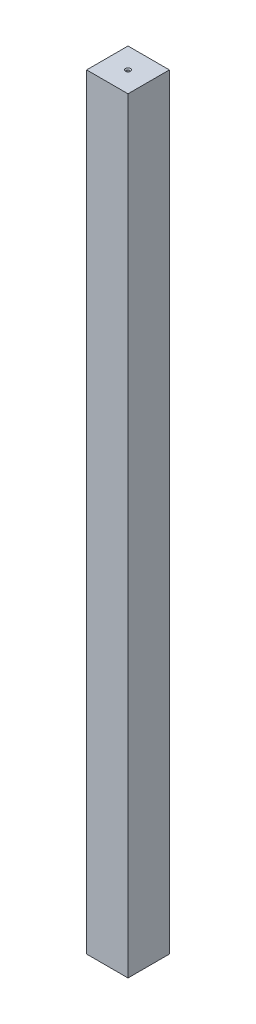
ISO-10303-21;
HEADER;
FILE_DESCRIPTION(('STEP AP214'),'2;1');
FILE_NAME('part.step','',(''),(''),'','','');
FILE_SCHEMA(('AUTOMOTIVE_DESIGN { 1 0 10303 214 1 1 1 1 }'));
ENDSEC;
DATA;
#1=APPLICATION_CONTEXT('core data for automotive mechanical design processes');
#2=APPLICATION_PROTOCOL_DEFINITION('international standard','automotive_design',2000,#1);
#3=PRODUCT_CONTEXT('',#1,'mechanical');
#4=PRODUCT('Part','Part','',(#3));
#5=PRODUCT_RELATED_PRODUCT_CATEGORY('part','',(#4));
#6=PRODUCT_DEFINITION_FORMATION('','',#4);
#7=PRODUCT_DEFINITION_CONTEXT('part definition',#1,'design');
#8=PRODUCT_DEFINITION('design','',#6,#7);
#9=PRODUCT_DEFINITION_SHAPE('','',#8);
#10=(LENGTH_UNIT() NAMED_UNIT(*) SI_UNIT(.MILLI.,.METRE.));
#11=(NAMED_UNIT(*) PLANE_ANGLE_UNIT() SI_UNIT($,.RADIAN.));
#12=(NAMED_UNIT(*) SI_UNIT($,.STERADIAN.) SOLID_ANGLE_UNIT());
#13=UNCERTAINTY_MEASURE_WITH_UNIT(LENGTH_MEASURE(1.E-05),#10,'distance_accuracy_value','');
#14=(GEOMETRIC_REPRESENTATION_CONTEXT(3) GLOBAL_UNCERTAINTY_ASSIGNED_CONTEXT((#13)) GLOBAL_UNIT_ASSIGNED_CONTEXT((#10,
#11,#12)) REPRESENTATION_CONTEXT('',''));
#15=CARTESIAN_POINT('',(0.,0.,0.));
#16=DIRECTION('',(0.,0.,1.));
#17=DIRECTION('',(1.,0.,0.));
#18=AXIS2_PLACEMENT_3D('',#15,#16,#17);
#19=CARTESIAN_POINT('',(12.7,235.,-12.7));
#20=DIRECTION('',(-1.,0.,0.));
#21=DIRECTION('',(0.,0.,1.));
#22=AXIS2_PLACEMENT_3D('',#19,#20,#21);
#23=PLANE('',#22);
#24=DIRECTION('',(0.,0.,-1.));
#25=VECTOR('',#24,1.);
#26=CARTESIAN_POINT('',(12.7,-235.,-12.7));
#27=LINE('',#26,#25);
#28=CARTESIAN_POINT('',(12.7,-235.,12.7));
#29=VERTEX_POINT('',#28);
#30=CARTESIAN_POINT('',(12.7,-235.,-12.7));
#31=VERTEX_POINT('',#30);
#32=EDGE_CURVE('E116',#29,#31,#27,.T.);
#33=ORIENTED_EDGE('',*,*,#32,.T.);
#34=DIRECTION('',(0.,-1.,0.));
#35=VECTOR('',#34,1.);
#36=CARTESIAN_POINT('',(12.7,235.,-12.7));
#37=LINE('',#36,#35);
#38=CARTESIAN_POINT('',(12.7,235.,-12.7));
#39=VERTEX_POINT('',#38);
#40=EDGE_CURVE('E11',#39,#31,#37,.T.);
#41=ORIENTED_EDGE('',*,*,#40,.F.);
#42=DIRECTION('',(0.,0.,-1.));
#43=VECTOR('',#42,1.);
#44=CARTESIAN_POINT('',(12.7,235.,-12.7));
#45=LINE('',#44,#43);
#46=CARTESIAN_POINT('',(12.7,235.,12.7));
#47=VERTEX_POINT('',#46);
#48=EDGE_CURVE('E117',#47,#39,#45,.T.);
#49=ORIENTED_EDGE('',*,*,#48,.F.);
#50=DIRECTION('',(0.,-1.,0.));
#51=VECTOR('',#50,1.);
#52=CARTESIAN_POINT('',(12.7,235.,12.7));
#53=LINE('',#52,#51);
#54=EDGE_CURVE('E123',#47,#29,#53,.T.);
#55=ORIENTED_EDGE('',*,*,#54,.T.);
#56=EDGE_LOOP('',(#33,#41,#49,#55));
#57=FACE_BOUND('',#56,.T.);
#58=ADVANCED_FACE('F36',(#57),#23,.F.);
#59=CARTESIAN_POINT('',(-12.7,235.,-12.7));
#60=DIRECTION('',(0.,0.,1.));
#61=DIRECTION('',(1.,0.,0.));
#62=AXIS2_PLACEMENT_3D('',#59,#60,#61);
#63=PLANE('',#62);
#64=DIRECTION('',(-1.,0.,0.));
#65=VECTOR('',#64,1.);
#66=CARTESIAN_POINT('',(-12.7,-235.,-12.7));
#67=LINE('',#66,#65);
#68=CARTESIAN_POINT('',(-12.7,-235.,-12.7));
#69=VERTEX_POINT('',#68);
#70=EDGE_CURVE('E126',#31,#69,#67,.T.);
#71=ORIENTED_EDGE('',*,*,#70,.T.);
#72=DIRECTION('',(0.,-1.,0.));
#73=VECTOR('',#72,1.);
#74=CARTESIAN_POINT('',(-12.7,235.,-12.7));
#75=LINE('',#74,#73);
#76=CARTESIAN_POINT('',(-12.7,235.,-12.7));
#77=VERTEX_POINT('',#76);
#78=EDGE_CURVE('E44',#77,#69,#75,.T.);
#79=ORIENTED_EDGE('',*,*,#78,.F.);
#80=DIRECTION('',(-1.,0.,0.));
#81=VECTOR('',#80,1.);
#82=CARTESIAN_POINT('',(-12.7,235.,-12.7));
#83=LINE('',#82,#81);
#84=EDGE_CURVE('E83',#39,#77,#83,.T.);
#85=ORIENTED_EDGE('',*,*,#84,.F.);
#86=ORIENTED_EDGE('',*,*,#40,.T.);
#87=EDGE_LOOP('',(#71,#79,#85,#86));
#88=FACE_BOUND('',#87,.T.);
#89=ADVANCED_FACE('F150',(#88),#63,.F.);
#90=CARTESIAN_POINT('',(-12.7,235.,-12.7));
#91=DIRECTION('',(1.,0.,0.));
#92=DIRECTION('',(0.,0.,-1.));
#93=AXIS2_PLACEMENT_3D('',#90,#91,#92);
#94=PLANE('',#93);
#95=DIRECTION('',(0.,0.,1.));
#96=VECTOR('',#95,1.);
#97=CARTESIAN_POINT('',(-12.7,-235.,-12.7));
#98=LINE('',#97,#96);
#99=CARTESIAN_POINT('',(-12.7,-235.,12.7));
#100=VERTEX_POINT('',#99);
#101=EDGE_CURVE('E70',#69,#100,#98,.T.);
#102=ORIENTED_EDGE('',*,*,#101,.T.);
#103=DIRECTION('',(0.,-1.,0.));
#104=VECTOR('',#103,1.);
#105=CARTESIAN_POINT('',(-12.7,235.,12.7));
#106=LINE('',#105,#104);
#107=CARTESIAN_POINT('',(-12.7,235.,12.7));
#108=VERTEX_POINT('',#107);
#109=EDGE_CURVE('E131',#108,#100,#106,.T.);
#110=ORIENTED_EDGE('',*,*,#109,.F.);
#111=DIRECTION('',(0.,0.,1.));
#112=VECTOR('',#111,1.);
#113=CARTESIAN_POINT('',(-12.7,235.,-12.7));
#114=LINE('',#113,#112);
#115=EDGE_CURVE('E120',#77,#108,#114,.T.);
#116=ORIENTED_EDGE('',*,*,#115,.F.);
#117=ORIENTED_EDGE('',*,*,#78,.T.);
#118=EDGE_LOOP('',(#102,#110,#116,#117));
#119=FACE_BOUND('',#118,.T.);
#120=ADVANCED_FACE('F133',(#119),#94,.F.);
#121=CARTESIAN_POINT('',(-12.7,235.,12.7));
#122=DIRECTION('',(0.,0.,-1.));
#123=DIRECTION('',(-1.,0.,0.));
#124=AXIS2_PLACEMENT_3D('',#121,#122,#123);
#125=PLANE('',#124);
#126=DIRECTION('',(1.,0.,0.));
#127=VECTOR('',#126,1.);
#128=CARTESIAN_POINT('',(-12.7,-235.,12.7));
#129=LINE('',#128,#127);
#130=EDGE_CURVE('E76',#100,#29,#129,.T.);
#131=ORIENTED_EDGE('',*,*,#130,.T.);
#132=ORIENTED_EDGE('',*,*,#54,.F.);
#133=DIRECTION('',(1.,0.,0.));
#134=VECTOR('',#133,1.);
#135=CARTESIAN_POINT('',(-12.7,235.,12.7));
#136=LINE('',#135,#134);
#137=EDGE_CURVE('E52',#108,#47,#136,.T.);
#138=ORIENTED_EDGE('',*,*,#137,.F.);
#139=ORIENTED_EDGE('',*,*,#109,.T.);
#140=EDGE_LOOP('',(#131,#132,#138,#139));
#141=FACE_BOUND('',#140,.T.);
#142=ADVANCED_FACE('F140',(#141),#125,.F.);
#143=CARTESIAN_POINT('',(0.,235.,0.));
#144=DIRECTION('',(0.,1.,0.));
#145=DIRECTION('',(0.,0.,1.));
#146=AXIS2_PLACEMENT_3D('',#143,#144,#145);
#147=PLANE('',#146);
#148=CARTESIAN_POINT('',(0.,235.,0.));
#149=DIRECTION('',(0.,1.,0.));
#150=DIRECTION('',(0.,0.,1.));
#151=AXIS2_PLACEMENT_3D('',#148,#149,#150);
#152=CIRCLE('',#151,1.5113);
#153=CARTESIAN_POINT('',(0.,235.,1.5113));
#154=VERTEX_POINT('',#153);
#155=EDGE_CURVE('E100',#154,#154,#152,.T.);
#156=ORIENTED_EDGE('',*,*,#155,.F.);
#157=EDGE_LOOP('',(#156));
#158=FACE_BOUND('',#157,.T.);
#159=ORIENTED_EDGE('',*,*,#48,.T.);
#160=ORIENTED_EDGE('',*,*,#84,.T.);
#161=ORIENTED_EDGE('',*,*,#115,.T.);
#162=ORIENTED_EDGE('',*,*,#137,.T.);
#163=EDGE_LOOP('',(#159,#160,#161,#162));
#164=FACE_BOUND('',#163,.T.);
#165=ADVANCED_FACE('F142',(#158,#164),#147,.T.);
#166=CARTESIAN_POINT('',(0.,-235.,0.));
#167=DIRECTION('',(0.,1.,0.));
#168=DIRECTION('',(0.,0.,1.));
#169=AXIS2_PLACEMENT_3D('',#166,#167,#168);
#170=PLANE('',#169);
#171=CARTESIAN_POINT('',(0.,-235.,0.));
#172=DIRECTION('',(0.,-1.,0.));
#173=DIRECTION('',(0.,0.,-1.));
#174=AXIS2_PLACEMENT_3D('',#171,#172,#173);
#175=CIRCLE('',#174,1.5113);
#176=CARTESIAN_POINT('',(0.,-235.,-1.5113));
#177=VERTEX_POINT('',#176);
#178=EDGE_CURVE('E107',#177,#177,#175,.T.);
#179=ORIENTED_EDGE('',*,*,#178,.F.);
#180=EDGE_LOOP('',(#179));
#181=FACE_BOUND('',#180,.T.);
#182=ORIENTED_EDGE('',*,*,#32,.F.);
#183=ORIENTED_EDGE('',*,*,#130,.F.);
#184=ORIENTED_EDGE('',*,*,#101,.F.);
#185=ORIENTED_EDGE('',*,*,#70,.F.);
#186=EDGE_LOOP('',(#182,#183,#184,#185));
#187=FACE_BOUND('',#186,.T.);
#188=ADVANCED_FACE('F136',(#181,#187),#170,.F.);
#189=CARTESIAN_POINT('',(0.,203.25,0.));
#190=DIRECTION('',(0.,1.,0.));
#191=DIRECTION('',(0.,0.,1.));
#192=AXIS2_PLACEMENT_3D('',#189,#190,#191);
#193=CONICAL_SURFACE('',#192,0.806449999999992,1.02974425867665);
#194=CARTESIAN_POINT('',(0.,202.765435953785,0.));
#195=VERTEX_POINT('',#194);
#196=VERTEX_LOOP('',#195);
#197=FACE_BOUND('',#196,.T.);
#198=CARTESIAN_POINT('',(0.,203.25,0.));
#199=DIRECTION('',(0.,1.,0.));
#200=DIRECTION('',(0.,0.,1.));
#201=AXIS2_PLACEMENT_3D('',#198,#199,#200);
#202=CIRCLE('',#201,0.806449999999992);
#203=CARTESIAN_POINT('',(0.,203.25,0.806449999999992));
#204=VERTEX_POINT('',#203);
#205=EDGE_CURVE('E113',#204,#204,#202,.T.);
#206=ORIENTED_EDGE('',*,*,#205,.T.);
#207=EDGE_LOOP('',(#206));
#208=FACE_BOUND('',#207,.T.);
#209=ADVANCED_FACE('F180',(#197,#208),#193,.F.);
#210=CARTESIAN_POINT('',(0.,235.,0.));
#211=DIRECTION('',(0.,1.,0.));
#212=DIRECTION('',(0.,0.,1.));
#213=AXIS2_PLACEMENT_3D('',#210,#211,#212);
#214=CYLINDRICAL_SURFACE('',#213,0.806449999999994);
#215=ORIENTED_EDGE('',*,*,#205,.F.);
#216=EDGE_LOOP('',(#215));
#217=FACE_BOUND('',#216,.T.);
#218=CARTESIAN_POINT('',(0.,234.408560624965,0.));
#219=DIRECTION('',(0.,1.,0.));
#220=DIRECTION('',(0.,0.,1.));
#221=AXIS2_PLACEMENT_3D('',#218,#219,#220);
#222=CIRCLE('',#221,0.806449999999996);
#223=CARTESIAN_POINT('',(0.,234.408560624965,0.806449999999996));
#224=VERTEX_POINT('',#223);
#225=EDGE_CURVE('E104',#224,#224,#222,.T.);
#226=ORIENTED_EDGE('',*,*,#225,.T.);
#227=EDGE_LOOP('',(#226));
#228=FACE_BOUND('',#227,.T.);
#229=ADVANCED_FACE('F185',(#217,#228),#214,.F.);
#230=CARTESIAN_POINT('',(0.,235.,0.));
#231=DIRECTION('',(0.,1.,0.));
#232=DIRECTION('',(0.,0.,1.));
#233=AXIS2_PLACEMENT_3D('',#230,#231,#232);
#234=CONICAL_SURFACE('',#233,1.5113,0.872664625997166);
#235=ORIENTED_EDGE('',*,*,#225,.F.);
#236=EDGE_LOOP('',(#235));
#237=FACE_BOUND('',#236,.T.);
#238=ORIENTED_EDGE('',*,*,#155,.T.);
#239=EDGE_LOOP('',(#238));
#240=FACE_BOUND('',#239,.T.);
#241=ADVANCED_FACE('F94',(#237,#240),#234,.F.);
#242=CARTESIAN_POINT('',(0.,-203.25,0.));
#243=DIRECTION('',(0.,-1.,0.));
#244=DIRECTION('',(0.,0.,-1.));
#245=AXIS2_PLACEMENT_3D('',#242,#243,#244);
#246=CONICAL_SURFACE('',#245,0.806449999999992,1.02974425867665);
#247=CARTESIAN_POINT('',(0.,-202.765435953785,0.));
#248=VERTEX_POINT('',#247);
#249=VERTEX_LOOP('',#248);
#250=FACE_BOUND('',#249,.T.);
#251=CARTESIAN_POINT('',(0.,-203.25,0.));
#252=DIRECTION('',(0.,-1.,0.));
#253=DIRECTION('',(0.,0.,-1.));
#254=AXIS2_PLACEMENT_3D('',#251,#252,#253);
#255=CIRCLE('',#254,0.806449999999992);
#256=CARTESIAN_POINT('',(0.,-203.25,-0.806449999999992));
#257=VERTEX_POINT('',#256);
#258=EDGE_CURVE('E98',#257,#257,#255,.T.);
#259=ORIENTED_EDGE('',*,*,#258,.T.);
#260=EDGE_LOOP('',(#259));
#261=FACE_BOUND('',#260,.T.);
#262=ADVANCED_FACE('F90',(#250,#261),#246,.F.);
#263=CARTESIAN_POINT('',(0.,-235.,0.));
#264=DIRECTION('',(0.,-1.,0.));
#265=DIRECTION('',(0.,0.,-1.));
#266=AXIS2_PLACEMENT_3D('',#263,#264,#265);
#267=CYLINDRICAL_SURFACE('',#266,0.806449999999994);
#268=ORIENTED_EDGE('',*,*,#258,.F.);
#269=EDGE_LOOP('',(#268));
#270=FACE_BOUND('',#269,.T.);
#271=CARTESIAN_POINT('',(0.,-234.408560624965,0.));
#272=DIRECTION('',(0.,-1.,0.));
#273=DIRECTION('',(0.,0.,-1.));
#274=AXIS2_PLACEMENT_3D('',#271,#272,#273);
#275=CIRCLE('',#274,0.806449999999996);
#276=CARTESIAN_POINT('',(0.,-234.408560624965,-0.806449999999996));
#277=VERTEX_POINT('',#276);
#278=EDGE_CURVE('E101',#277,#277,#275,.T.);
#279=ORIENTED_EDGE('',*,*,#278,.T.);
#280=EDGE_LOOP('',(#279));
#281=FACE_BOUND('',#280,.T.);
#282=ADVANCED_FACE('F93',(#270,#281),#267,.F.);
#283=CARTESIAN_POINT('',(0.,-235.,0.));
#284=DIRECTION('',(0.,-1.,0.));
#285=DIRECTION('',(0.,0.,-1.));
#286=AXIS2_PLACEMENT_3D('',#283,#284,#285);
#287=CONICAL_SURFACE('',#286,1.5113,0.872664625997166);
#288=ORIENTED_EDGE('',*,*,#278,.F.);
#289=EDGE_LOOP('',(#288));
#290=FACE_BOUND('',#289,.T.);
#291=ORIENTED_EDGE('',*,*,#178,.T.);
#292=EDGE_LOOP('',(#291));
#293=FACE_BOUND('',#292,.T.);
#294=ADVANCED_FACE('F228',(#290,#293),#287,.F.);
#295=CLOSED_SHELL('',(#58,#89,#120,#142,#165,#188,#209,#229,#241,#262,#282,#294));
#296=MANIFOLD_SOLID_BREP('B2',#295);
#297=ADVANCED_BREP_SHAPE_REPRESENTATION('',(#18,#296),#14);
#298=SHAPE_DEFINITION_REPRESENTATION(#9,#297);
ENDSEC;
END-ISO-10303-21;
